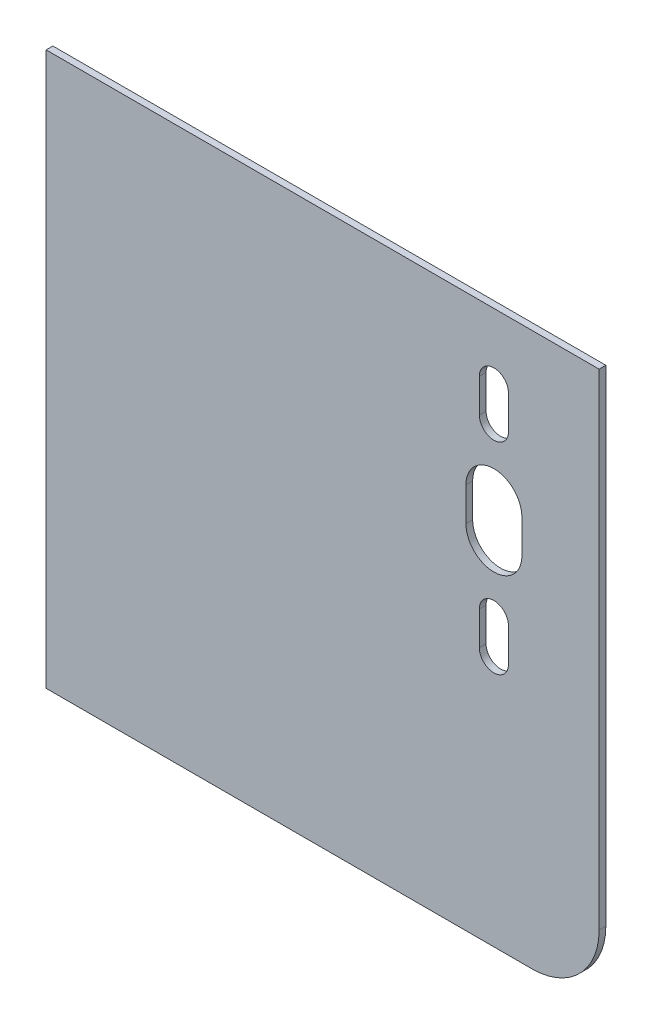
ISO-10303-21;
HEADER;
FILE_DESCRIPTION(('STEP AP214'),'2;1');
FILE_NAME('part.step','',(''),(''),'','','');
FILE_SCHEMA(('AUTOMOTIVE_DESIGN { 1 0 10303 214 1 1 1 1 }'));
ENDSEC;
DATA;
#1=APPLICATION_CONTEXT('core data for automotive mechanical design processes');
#2=APPLICATION_PROTOCOL_DEFINITION('international standard','automotive_design',2000,#1);
#3=PRODUCT_CONTEXT('',#1,'mechanical');
#4=PRODUCT('Part','Part','',(#3));
#5=PRODUCT_RELATED_PRODUCT_CATEGORY('part','',(#4));
#6=PRODUCT_DEFINITION_FORMATION('','',#4);
#7=PRODUCT_DEFINITION_CONTEXT('part definition',#1,'design');
#8=PRODUCT_DEFINITION('design','',#6,#7);
#9=PRODUCT_DEFINITION_SHAPE('','',#8);
#10=(LENGTH_UNIT() NAMED_UNIT(*) SI_UNIT(.MILLI.,.METRE.));
#11=(NAMED_UNIT(*) PLANE_ANGLE_UNIT() SI_UNIT($,.RADIAN.));
#12=(NAMED_UNIT(*) SI_UNIT($,.STERADIAN.) SOLID_ANGLE_UNIT());
#13=UNCERTAINTY_MEASURE_WITH_UNIT(LENGTH_MEASURE(1.E-05),#10,'distance_accuracy_value','');
#14=(GEOMETRIC_REPRESENTATION_CONTEXT(3) GLOBAL_UNCERTAINTY_ASSIGNED_CONTEXT((#13)) GLOBAL_UNIT_ASSIGNED_CONTEXT((#10,
#11,#12)) REPRESENTATION_CONTEXT('',''));
#15=CARTESIAN_POINT('',(0.,0.,0.));
#16=DIRECTION('',(0.,0.,1.));
#17=DIRECTION('',(1.,0.,0.));
#18=AXIS2_PLACEMENT_3D('',#15,#16,#17);
#19=CARTESIAN_POINT('',(0.,0.,3.));
#20=DIRECTION('',(0.,0.,-1.));
#21=DIRECTION('',(-1.,0.,0.));
#22=AXIS2_PLACEMENT_3D('',#19,#20,#21);
#23=PLANE('',#22);
#24=DIRECTION('',(1.,0.,0.));
#25=VECTOR('',#24,1.);
#26=CARTESIAN_POINT('',(-123.5,-123.5,3.));
#27=LINE('',#26,#25);
#28=CARTESIAN_POINT('',(-123.5,-123.5,3.));
#29=VERTEX_POINT('',#28);
#30=CARTESIAN_POINT('',(93.5,-123.5,3.));
#31=VERTEX_POINT('',#30);
#32=EDGE_CURVE('E259',#29,#31,#27,.T.);
#33=ORIENTED_EDGE('',*,*,#32,.T.);
#34=CARTESIAN_POINT('',(93.5,-93.5,3.));
#35=DIRECTION('',(0.,0.,-1.));
#36=DIRECTION('',(-1.,0.,0.));
#37=AXIS2_PLACEMENT_3D('',#34,#35,#36);
#38=CIRCLE('',#37,30.);
#39=CARTESIAN_POINT('',(123.5,-93.5,3.));
#40=VERTEX_POINT('',#39);
#41=EDGE_CURVE('E11',#31,#40,#38,.F.);
#42=ORIENTED_EDGE('',*,*,#41,.T.);
#43=DIRECTION('',(0.,1.,0.));
#44=VECTOR('',#43,1.);
#45=CARTESIAN_POINT('',(123.5,-123.5,3.));
#46=LINE('',#45,#44);
#47=CARTESIAN_POINT('',(123.5,123.5,3.));
#48=VERTEX_POINT('',#47);
#49=EDGE_CURVE('E252',#40,#48,#46,.T.);
#50=ORIENTED_EDGE('',*,*,#49,.T.);
#51=DIRECTION('',(-1.,0.,0.));
#52=VECTOR('',#51,1.);
#53=CARTESIAN_POINT('',(-123.5,123.5,3.));
#54=LINE('',#53,#52);
#55=CARTESIAN_POINT('',(-123.5,123.5,3.));
#56=VERTEX_POINT('',#55);
#57=EDGE_CURVE('E254',#48,#56,#54,.T.);
#58=ORIENTED_EDGE('',*,*,#57,.T.);
#59=DIRECTION('',(0.,-1.,0.));
#60=VECTOR('',#59,1.);
#61=CARTESIAN_POINT('',(-123.5,-123.5,3.));
#62=LINE('',#61,#60);
#63=EDGE_CURVE('E257',#56,#29,#62,.T.);
#64=ORIENTED_EDGE('',*,*,#63,.T.);
#65=EDGE_LOOP('',(#33,#42,#50,#58,#64));
#66=FACE_BOUND('',#65,.T.);
#67=DIRECTION('',(0.,-1.,0.));
#68=VECTOR('',#67,1.);
#69=CARTESIAN_POINT('',(89.,0.,3.));
#70=LINE('',#69,#68);
#71=CARTESIAN_POINT('',(89.,49.,3.));
#72=VERTEX_POINT('',#71);
#73=CARTESIAN_POINT('',(89.,34.,3.));
#74=VERTEX_POINT('',#73);
#75=EDGE_CURVE('E235',#72,#74,#70,.T.);
#76=ORIENTED_EDGE('',*,*,#75,.T.);
#77=CARTESIAN_POINT('',(76.5,34.,3.));
#78=DIRECTION('',(0.,0.,-1.));
#79=DIRECTION('',(-1.,0.,0.));
#80=AXIS2_PLACEMENT_3D('',#77,#78,#79);
#81=CIRCLE('',#80,12.5);
#82=CARTESIAN_POINT('',(64.,34.,3.));
#83=VERTEX_POINT('',#82);
#84=EDGE_CURVE('E240',#74,#83,#81,.T.);
#85=ORIENTED_EDGE('',*,*,#84,.T.);
#86=DIRECTION('',(0.,1.,0.));
#87=VECTOR('',#86,1.);
#88=CARTESIAN_POINT('',(64.,0.,3.));
#89=LINE('',#88,#87);
#90=CARTESIAN_POINT('',(64.,49.,3.));
#91=VERTEX_POINT('',#90);
#92=EDGE_CURVE('E233',#83,#91,#89,.T.);
#93=ORIENTED_EDGE('',*,*,#92,.T.);
#94=CARTESIAN_POINT('',(76.5,49.,3.));
#95=DIRECTION('',(0.,0.,-1.));
#96=DIRECTION('',(-1.,0.,0.));
#97=AXIS2_PLACEMENT_3D('',#94,#95,#96);
#98=CIRCLE('',#97,12.5);
#99=EDGE_CURVE('E237',#91,#72,#98,.T.);
#100=ORIENTED_EDGE('',*,*,#99,.T.);
#101=EDGE_LOOP('',(#76,#85,#93,#100));
#102=FACE_BOUND('',#101,.T.);
#103=DIRECTION('',(0.,-1.,0.));
#104=VECTOR('',#103,1.);
#105=CARTESIAN_POINT('',(83.,0.,3.));
#106=LINE('',#105,#104);
#107=CARTESIAN_POINT('',(83.,94.,3.));
#108=VERTEX_POINT('',#107);
#109=CARTESIAN_POINT('',(83.,79.,3.));
#110=VERTEX_POINT('',#109);
#111=EDGE_CURVE('E231',#108,#110,#106,.T.);
#112=ORIENTED_EDGE('',*,*,#111,.T.);
#113=CARTESIAN_POINT('',(76.5,79.,3.));
#114=DIRECTION('',(0.,0.,-1.));
#115=DIRECTION('',(-1.,0.,0.));
#116=AXIS2_PLACEMENT_3D('',#113,#114,#115);
#117=CIRCLE('',#116,6.50000000000001);
#118=CARTESIAN_POINT('',(70.,79.,3.));
#119=VERTEX_POINT('',#118);
#120=EDGE_CURVE('E249',#110,#119,#117,.T.);
#121=ORIENTED_EDGE('',*,*,#120,.T.);
#122=DIRECTION('',(0.,1.,0.));
#123=VECTOR('',#122,1.);
#124=CARTESIAN_POINT('',(70.,0.,3.));
#125=LINE('',#124,#123);
#126=CARTESIAN_POINT('',(70.,94.,3.));
#127=VERTEX_POINT('',#126);
#128=EDGE_CURVE('E48',#119,#127,#125,.T.);
#129=ORIENTED_EDGE('',*,*,#128,.T.);
#130=CARTESIAN_POINT('',(76.5,94.,3.));
#131=DIRECTION('',(0.,0.,-1.));
#132=DIRECTION('',(-1.,0.,0.));
#133=AXIS2_PLACEMENT_3D('',#130,#131,#132);
#134=CIRCLE('',#133,6.50000000000001);
#135=EDGE_CURVE('E247',#127,#108,#134,.T.);
#136=ORIENTED_EDGE('',*,*,#135,.T.);
#137=EDGE_LOOP('',(#112,#121,#129,#136));
#138=FACE_BOUND('',#137,.T.);
#139=DIRECTION('',(0.,-1.,0.));
#140=VECTOR('',#139,1.);
#141=CARTESIAN_POINT('',(83.,0.,3.));
#142=LINE('',#141,#140);
#143=CARTESIAN_POINT('',(83.,4.,3.));
#144=VERTEX_POINT('',#143);
#145=CARTESIAN_POINT('',(83.,-11.,3.));
#146=VERTEX_POINT('',#145);
#147=EDGE_CURVE('E228',#144,#146,#142,.T.);
#148=ORIENTED_EDGE('',*,*,#147,.T.);
#149=CARTESIAN_POINT('',(76.5,-11.,3.));
#150=DIRECTION('',(0.,0.,-1.));
#151=DIRECTION('',(-1.,0.,0.));
#152=AXIS2_PLACEMENT_3D('',#149,#150,#151);
#153=CIRCLE('',#152,6.50000000000001);
#154=CARTESIAN_POINT('',(70.,-11.,3.));
#155=VERTEX_POINT('',#154);
#156=EDGE_CURVE('E245',#146,#155,#153,.T.);
#157=ORIENTED_EDGE('',*,*,#156,.T.);
#158=DIRECTION('',(0.,1.,0.));
#159=VECTOR('',#158,1.);
#160=CARTESIAN_POINT('',(70.,0.,3.));
#161=LINE('',#160,#159);
#162=CARTESIAN_POINT('',(70.,4.,3.));
#163=VERTEX_POINT('',#162);
#164=EDGE_CURVE('E56',#155,#163,#161,.T.);
#165=ORIENTED_EDGE('',*,*,#164,.T.);
#166=CARTESIAN_POINT('',(76.5,4.,3.));
#167=DIRECTION('',(0.,0.,-1.));
#168=DIRECTION('',(-1.,0.,0.));
#169=AXIS2_PLACEMENT_3D('',#166,#167,#168);
#170=CIRCLE('',#169,6.50000000000001);
#171=EDGE_CURVE('E243',#163,#144,#170,.T.);
#172=ORIENTED_EDGE('',*,*,#171,.T.);
#173=EDGE_LOOP('',(#148,#157,#165,#172));
#174=FACE_BOUND('',#173,.T.);
#175=ADVANCED_FACE('F33',(#66,#102,#138,#174),#23,.F.);
#176=CARTESIAN_POINT('',(0.,0.,0.));
#177=DIRECTION('',(0.,0.,-1.));
#178=DIRECTION('',(-1.,0.,0.));
#179=AXIS2_PLACEMENT_3D('',#176,#177,#178);
#180=PLANE('',#179);
#181=CARTESIAN_POINT('',(76.5,79.,0.));
#182=DIRECTION('',(0.,0.,-1.));
#183=DIRECTION('',(-1.,0.,0.));
#184=AXIS2_PLACEMENT_3D('',#181,#182,#183);
#185=CIRCLE('',#184,6.50000000000001);
#186=CARTESIAN_POINT('',(83.,79.,0.));
#187=VERTEX_POINT('',#186);
#188=CARTESIAN_POINT('',(70.,79.,0.));
#189=VERTEX_POINT('',#188);
#190=EDGE_CURVE('E160',#187,#189,#185,.T.);
#191=ORIENTED_EDGE('',*,*,#190,.F.);
#192=DIRECTION('',(0.,-1.,0.));
#193=VECTOR('',#192,1.);
#194=CARTESIAN_POINT('',(83.,79.,0.));
#195=LINE('',#194,#193);
#196=CARTESIAN_POINT('',(83.,94.,0.));
#197=VERTEX_POINT('',#196);
#198=EDGE_CURVE('E171',#197,#187,#195,.T.);
#199=ORIENTED_EDGE('',*,*,#198,.F.);
#200=CARTESIAN_POINT('',(76.5,94.,0.));
#201=DIRECTION('',(0.,0.,-1.));
#202=DIRECTION('',(-1.,0.,0.));
#203=AXIS2_PLACEMENT_3D('',#200,#201,#202);
#204=CIRCLE('',#203,6.50000000000001);
#205=CARTESIAN_POINT('',(70.,94.,0.));
#206=VERTEX_POINT('',#205);
#207=EDGE_CURVE('E162',#206,#197,#204,.T.);
#208=ORIENTED_EDGE('',*,*,#207,.F.);
#209=DIRECTION('',(0.,1.,0.));
#210=VECTOR('',#209,1.);
#211=CARTESIAN_POINT('',(70.,79.,0.));
#212=LINE('',#211,#210);
#213=EDGE_CURVE('E154',#189,#206,#212,.T.);
#214=ORIENTED_EDGE('',*,*,#213,.F.);
#215=EDGE_LOOP('',(#191,#199,#208,#214));
#216=FACE_BOUND('',#215,.T.);
#217=CARTESIAN_POINT('',(76.5,-11.,0.));
#218=DIRECTION('',(0.,0.,-1.));
#219=DIRECTION('',(-1.,0.,0.));
#220=AXIS2_PLACEMENT_3D('',#217,#218,#219);
#221=CIRCLE('',#220,6.50000000000001);
#222=CARTESIAN_POINT('',(83.,-11.,0.));
#223=VERTEX_POINT('',#222);
#224=CARTESIAN_POINT('',(70.,-11.,0.));
#225=VERTEX_POINT('',#224);
#226=EDGE_CURVE('E189',#223,#225,#221,.T.);
#227=ORIENTED_EDGE('',*,*,#226,.F.);
#228=DIRECTION('',(0.,-1.,0.));
#229=VECTOR('',#228,1.);
#230=CARTESIAN_POINT('',(83.,-11.,0.));
#231=LINE('',#230,#229);
#232=CARTESIAN_POINT('',(83.,4.,0.));
#233=VERTEX_POINT('',#232);
#234=EDGE_CURVE('E199',#233,#223,#231,.T.);
#235=ORIENTED_EDGE('',*,*,#234,.F.);
#236=CARTESIAN_POINT('',(76.5,4.,0.));
#237=DIRECTION('',(0.,0.,-1.));
#238=DIRECTION('',(-1.,0.,0.));
#239=AXIS2_PLACEMENT_3D('',#236,#237,#238);
#240=CIRCLE('',#239,6.50000000000001);
#241=CARTESIAN_POINT('',(70.,4.,0.));
#242=VERTEX_POINT('',#241);
#243=EDGE_CURVE('E196',#242,#233,#240,.T.);
#244=ORIENTED_EDGE('',*,*,#243,.F.);
#245=DIRECTION('',(0.,1.,0.));
#246=VECTOR('',#245,1.);
#247=CARTESIAN_POINT('',(70.,-11.,0.));
#248=LINE('',#247,#246);
#249=EDGE_CURVE('E192',#225,#242,#248,.T.);
#250=ORIENTED_EDGE('',*,*,#249,.F.);
#251=EDGE_LOOP('',(#227,#235,#244,#250));
#252=FACE_BOUND('',#251,.T.);
#253=CARTESIAN_POINT('',(76.5,34.,0.));
#254=DIRECTION('',(0.,0.,-1.));
#255=DIRECTION('',(-1.,0.,0.));
#256=AXIS2_PLACEMENT_3D('',#253,#254,#255);
#257=CIRCLE('',#256,12.5);
#258=CARTESIAN_POINT('',(89.,34.,0.));
#259=VERTEX_POINT('',#258);
#260=CARTESIAN_POINT('',(64.,34.,0.));
#261=VERTEX_POINT('',#260);
#262=EDGE_CURVE('E207',#259,#261,#257,.T.);
#263=ORIENTED_EDGE('',*,*,#262,.F.);
#264=DIRECTION('',(0.,-1.,0.));
#265=VECTOR('',#264,1.);
#266=CARTESIAN_POINT('',(89.,34.,0.));
#267=LINE('',#266,#265);
#268=CARTESIAN_POINT('',(89.,49.,0.));
#269=VERTEX_POINT('',#268);
#270=EDGE_CURVE('E216',#269,#259,#267,.T.);
#271=ORIENTED_EDGE('',*,*,#270,.F.);
#272=CARTESIAN_POINT('',(76.5,49.,0.));
#273=DIRECTION('',(0.,0.,-1.));
#274=DIRECTION('',(-1.,0.,0.));
#275=AXIS2_PLACEMENT_3D('',#272,#273,#274);
#276=CIRCLE('',#275,12.5);
#277=CARTESIAN_POINT('',(64.,49.,0.));
#278=VERTEX_POINT('',#277);
#279=EDGE_CURVE('E213',#278,#269,#276,.T.);
#280=ORIENTED_EDGE('',*,*,#279,.F.);
#281=DIRECTION('',(0.,1.,0.));
#282=VECTOR('',#281,1.);
#283=CARTESIAN_POINT('',(64.,34.,0.));
#284=LINE('',#283,#282);
#285=EDGE_CURVE('E210',#261,#278,#284,.T.);
#286=ORIENTED_EDGE('',*,*,#285,.F.);
#287=EDGE_LOOP('',(#263,#271,#280,#286));
#288=FACE_BOUND('',#287,.T.);
#289=DIRECTION('',(0.,1.,0.));
#290=VECTOR('',#289,1.);
#291=CARTESIAN_POINT('',(123.5,-123.5,0.));
#292=LINE('',#291,#290);
#293=CARTESIAN_POINT('',(123.5,-93.5,0.));
#294=VERTEX_POINT('',#293);
#295=CARTESIAN_POINT('',(123.5,123.5,0.));
#296=VERTEX_POINT('',#295);
#297=EDGE_CURVE('E251',#294,#296,#292,.T.);
#298=ORIENTED_EDGE('',*,*,#297,.F.);
#299=CARTESIAN_POINT('',(93.5,-93.5,0.));
#300=DIRECTION('',(0.,0.,-1.));
#301=DIRECTION('',(-1.,0.,0.));
#302=AXIS2_PLACEMENT_3D('',#299,#300,#301);
#303=CIRCLE('',#302,30.);
#304=CARTESIAN_POINT('',(93.5,-123.5,0.));
#305=VERTEX_POINT('',#304);
#306=EDGE_CURVE('E281',#294,#305,#303,.T.);
#307=ORIENTED_EDGE('',*,*,#306,.T.);
#308=DIRECTION('',(1.,0.,0.));
#309=VECTOR('',#308,1.);
#310=CARTESIAN_POINT('',(-123.5,-123.5,0.));
#311=LINE('',#310,#309);
#312=CARTESIAN_POINT('',(-123.5,-123.5,0.));
#313=VERTEX_POINT('',#312);
#314=EDGE_CURVE('E255',#313,#305,#311,.T.);
#315=ORIENTED_EDGE('',*,*,#314,.F.);
#316=DIRECTION('',(0.,-1.,0.));
#317=VECTOR('',#316,1.);
#318=CARTESIAN_POINT('',(-123.5,-123.5,0.));
#319=LINE('',#318,#317);
#320=CARTESIAN_POINT('',(-123.5,123.5,0.));
#321=VERTEX_POINT('',#320);
#322=EDGE_CURVE('E266',#321,#313,#319,.T.);
#323=ORIENTED_EDGE('',*,*,#322,.F.);
#324=DIRECTION('',(-1.,0.,0.));
#325=VECTOR('',#324,1.);
#326=CARTESIAN_POINT('',(-123.5,123.5,0.));
#327=LINE('',#326,#325);
#328=EDGE_CURVE('E264',#296,#321,#327,.T.);
#329=ORIENTED_EDGE('',*,*,#328,.F.);
#330=EDGE_LOOP('',(#298,#307,#315,#323,#329));
#331=FACE_BOUND('',#330,.T.);
#332=ADVANCED_FACE('F156',(#216,#252,#288,#331),#180,.T.);
#333=CARTESIAN_POINT('',(123.5,-123.5,3.));
#334=DIRECTION('',(-1.,0.,0.));
#335=DIRECTION('',(0.,0.,1.));
#336=AXIS2_PLACEMENT_3D('',#333,#334,#335);
#337=PLANE('',#336);
#338=ORIENTED_EDGE('',*,*,#49,.F.);
#339=DIRECTION('',(0.,0.,-1.));
#340=VECTOR('',#339,1.);
#341=CARTESIAN_POINT('',(123.5,-93.5,3.));
#342=LINE('',#341,#340);
#343=EDGE_CURVE('E278',#40,#294,#342,.T.);
#344=ORIENTED_EDGE('',*,*,#343,.T.);
#345=ORIENTED_EDGE('',*,*,#297,.T.);
#346=DIRECTION('',(0.,0.,-1.));
#347=VECTOR('',#346,1.);
#348=CARTESIAN_POINT('',(123.5,123.5,3.));
#349=LINE('',#348,#347);
#350=EDGE_CURVE('E275',#48,#296,#349,.T.);
#351=ORIENTED_EDGE('',*,*,#350,.F.);
#352=EDGE_LOOP('',(#338,#344,#345,#351));
#353=FACE_BOUND('',#352,.T.);
#354=ADVANCED_FACE('F297',(#353),#337,.F.);
#355=CARTESIAN_POINT('',(-123.5,123.5,3.));
#356=DIRECTION('',(0.,-1.,0.));
#357=DIRECTION('',(0.,0.,-1.));
#358=AXIS2_PLACEMENT_3D('',#355,#356,#357);
#359=PLANE('',#358);
#360=ORIENTED_EDGE('',*,*,#328,.T.);
#361=DIRECTION('',(0.,0.,-1.));
#362=VECTOR('',#361,1.);
#363=CARTESIAN_POINT('',(-123.5,123.5,3.));
#364=LINE('',#363,#362);
#365=EDGE_CURVE('E272',#56,#321,#364,.T.);
#366=ORIENTED_EDGE('',*,*,#365,.F.);
#367=ORIENTED_EDGE('',*,*,#57,.F.);
#368=ORIENTED_EDGE('',*,*,#350,.T.);
#369=EDGE_LOOP('',(#360,#366,#367,#368));
#370=FACE_BOUND('',#369,.T.);
#371=ADVANCED_FACE('F305',(#370),#359,.F.);
#372=CARTESIAN_POINT('',(-123.5,-123.5,3.));
#373=DIRECTION('',(1.,0.,0.));
#374=DIRECTION('',(0.,0.,-1.));
#375=AXIS2_PLACEMENT_3D('',#372,#373,#374);
#376=PLANE('',#375);
#377=ORIENTED_EDGE('',*,*,#322,.T.);
#378=DIRECTION('',(0.,0.,-1.));
#379=VECTOR('',#378,1.);
#380=CARTESIAN_POINT('',(-123.5,-123.5,3.));
#381=LINE('',#380,#379);
#382=EDGE_CURVE('E262',#29,#313,#381,.T.);
#383=ORIENTED_EDGE('',*,*,#382,.F.);
#384=ORIENTED_EDGE('',*,*,#63,.F.);
#385=ORIENTED_EDGE('',*,*,#365,.T.);
#386=EDGE_LOOP('',(#377,#383,#384,#385));
#387=FACE_BOUND('',#386,.T.);
#388=ADVANCED_FACE('F307',(#387),#376,.F.);
#389=CARTESIAN_POINT('',(-123.5,-123.5,3.));
#390=DIRECTION('',(0.,1.,0.));
#391=DIRECTION('',(0.,0.,1.));
#392=AXIS2_PLACEMENT_3D('',#389,#390,#391);
#393=PLANE('',#392);
#394=ORIENTED_EDGE('',*,*,#314,.T.);
#395=DIRECTION('',(0.,0.,-1.));
#396=VECTOR('',#395,1.);
#397=CARTESIAN_POINT('',(93.5,-123.5,3.));
#398=LINE('',#397,#396);
#399=EDGE_CURVE('E41',#305,#31,#398,.F.);
#400=ORIENTED_EDGE('',*,*,#399,.T.);
#401=ORIENTED_EDGE('',*,*,#32,.F.);
#402=ORIENTED_EDGE('',*,*,#382,.T.);
#403=EDGE_LOOP('',(#394,#400,#401,#402));
#404=FACE_BOUND('',#403,.T.);
#405=ADVANCED_FACE('F285',(#404),#393,.F.);
#406=CARTESIAN_POINT('',(93.5,-93.5,3.));
#407=DIRECTION('',(0.,0.,-1.));
#408=DIRECTION('',(-1.,0.,0.));
#409=AXIS2_PLACEMENT_3D('',#406,#407,#408);
#410=CYLINDRICAL_SURFACE('',#409,30.);
#411=ORIENTED_EDGE('',*,*,#41,.F.);
#412=ORIENTED_EDGE('',*,*,#399,.F.);
#413=ORIENTED_EDGE('',*,*,#306,.F.);
#414=ORIENTED_EDGE('',*,*,#343,.F.);
#415=EDGE_LOOP('',(#411,#412,#413,#414));
#416=FACE_BOUND('',#415,.T.);
#417=ADVANCED_FACE('F35',(#416),#410,.T.);
#418=CARTESIAN_POINT('',(76.5,34.,10.));
#419=DIRECTION('',(0.,0.,-1.));
#420=DIRECTION('',(-1.,0.,0.));
#421=AXIS2_PLACEMENT_3D('',#418,#419,#420);
#422=CYLINDRICAL_SURFACE('',#421,12.5);
#423=DIRECTION('',(0.,0.,-1.));
#424=VECTOR('',#423,1.);
#425=CARTESIAN_POINT('',(89.,34.,10.));
#426=LINE('',#425,#424);
#427=EDGE_CURVE('E193',#74,#259,#426,.T.);
#428=ORIENTED_EDGE('',*,*,#427,.T.);
#429=ORIENTED_EDGE('',*,*,#262,.T.);
#430=DIRECTION('',(0.,0.,-1.));
#431=VECTOR('',#430,1.);
#432=CARTESIAN_POINT('',(64.,34.,10.));
#433=LINE('',#432,#431);
#434=EDGE_CURVE('E218',#83,#261,#433,.T.);
#435=ORIENTED_EDGE('',*,*,#434,.F.);
#436=ORIENTED_EDGE('',*,*,#84,.F.);
#437=EDGE_LOOP('',(#428,#429,#435,#436));
#438=FACE_BOUND('',#437,.T.);
#439=ADVANCED_FACE('F323',(#438),#422,.F.);
#440=CARTESIAN_POINT('',(76.5,49.,10.));
#441=DIRECTION('',(0.,0.,-1.));
#442=DIRECTION('',(-1.,0.,0.));
#443=AXIS2_PLACEMENT_3D('',#440,#441,#442);
#444=CYLINDRICAL_SURFACE('',#443,12.5);
#445=DIRECTION('',(0.,0.,-1.));
#446=VECTOR('',#445,1.);
#447=CARTESIAN_POINT('',(64.,49.,10.));
#448=LINE('',#447,#446);
#449=EDGE_CURVE('E223',#91,#278,#448,.T.);
#450=ORIENTED_EDGE('',*,*,#449,.T.);
#451=ORIENTED_EDGE('',*,*,#279,.T.);
#452=DIRECTION('',(0.,0.,-1.));
#453=VECTOR('',#452,1.);
#454=CARTESIAN_POINT('',(89.,49.,10.));
#455=LINE('',#454,#453);
#456=EDGE_CURVE('E221',#72,#269,#455,.T.);
#457=ORIENTED_EDGE('',*,*,#456,.F.);
#458=ORIENTED_EDGE('',*,*,#99,.F.);
#459=EDGE_LOOP('',(#450,#451,#457,#458));
#460=FACE_BOUND('',#459,.T.);
#461=ADVANCED_FACE('F326',(#460),#444,.F.);
#462=CARTESIAN_POINT('',(89.,34.,10.));
#463=DIRECTION('',(1.,0.,0.));
#464=DIRECTION('',(0.,0.,-1.));
#465=AXIS2_PLACEMENT_3D('',#462,#463,#464);
#466=PLANE('',#465);
#467=ORIENTED_EDGE('',*,*,#456,.T.);
#468=ORIENTED_EDGE('',*,*,#270,.T.);
#469=ORIENTED_EDGE('',*,*,#427,.F.);
#470=ORIENTED_EDGE('',*,*,#75,.F.);
#471=EDGE_LOOP('',(#467,#468,#469,#470));
#472=FACE_BOUND('',#471,.T.);
#473=ADVANCED_FACE('F332',(#472),#466,.F.);
#474=CARTESIAN_POINT('',(64.,34.,10.));
#475=DIRECTION('',(-1.,0.,0.));
#476=DIRECTION('',(0.,0.,1.));
#477=AXIS2_PLACEMENT_3D('',#474,#475,#476);
#478=PLANE('',#477);
#479=ORIENTED_EDGE('',*,*,#434,.T.);
#480=ORIENTED_EDGE('',*,*,#285,.T.);
#481=ORIENTED_EDGE('',*,*,#449,.F.);
#482=ORIENTED_EDGE('',*,*,#92,.F.);
#483=EDGE_LOOP('',(#479,#480,#481,#482));
#484=FACE_BOUND('',#483,.T.);
#485=ADVANCED_FACE('F328',(#484),#478,.F.);
#486=CARTESIAN_POINT('',(76.5,-11.,10.));
#487=DIRECTION('',(0.,0.,-1.));
#488=DIRECTION('',(-1.,0.,0.));
#489=AXIS2_PLACEMENT_3D('',#486,#487,#488);
#490=CYLINDRICAL_SURFACE('',#489,6.50000000000001);
#491=DIRECTION('',(0.,0.,-1.));
#492=VECTOR('',#491,1.);
#493=CARTESIAN_POINT('',(83.,-11.,10.));
#494=LINE('',#493,#492);
#495=EDGE_CURVE('E177',#146,#223,#494,.T.);
#496=ORIENTED_EDGE('',*,*,#495,.T.);
#497=ORIENTED_EDGE('',*,*,#226,.T.);
#498=DIRECTION('',(0.,0.,-1.));
#499=VECTOR('',#498,1.);
#500=CARTESIAN_POINT('',(70.,-11.,10.));
#501=LINE('',#500,#499);
#502=EDGE_CURVE('E200',#155,#225,#501,.T.);
#503=ORIENTED_EDGE('',*,*,#502,.F.);
#504=ORIENTED_EDGE('',*,*,#156,.F.);
#505=EDGE_LOOP('',(#496,#497,#503,#504));
#506=FACE_BOUND('',#505,.T.);
#507=ADVANCED_FACE('F331',(#506),#490,.F.);
#508=CARTESIAN_POINT('',(76.5,4.,10.));
#509=DIRECTION('',(0.,0.,-1.));
#510=DIRECTION('',(-1.,0.,0.));
#511=AXIS2_PLACEMENT_3D('',#508,#509,#510);
#512=CYLINDRICAL_SURFACE('',#511,6.50000000000001);
#513=DIRECTION('',(0.,0.,-1.));
#514=VECTOR('',#513,1.);
#515=CARTESIAN_POINT('',(70.,4.,10.));
#516=LINE('',#515,#514);
#517=EDGE_CURVE('E203',#163,#242,#516,.T.);
#518=ORIENTED_EDGE('',*,*,#517,.T.);
#519=ORIENTED_EDGE('',*,*,#243,.T.);
#520=DIRECTION('',(0.,0.,-1.));
#521=VECTOR('',#520,1.);
#522=CARTESIAN_POINT('',(83.,4.,10.));
#523=LINE('',#522,#521);
#524=EDGE_CURVE('E180',#144,#233,#523,.T.);
#525=ORIENTED_EDGE('',*,*,#524,.F.);
#526=ORIENTED_EDGE('',*,*,#171,.F.);
#527=EDGE_LOOP('',(#518,#519,#525,#526));
#528=FACE_BOUND('',#527,.T.);
#529=ADVANCED_FACE('F342',(#528),#512,.F.);
#530=CARTESIAN_POINT('',(83.,-11.,10.));
#531=DIRECTION('',(1.,0.,0.));
#532=DIRECTION('',(0.,0.,-1.));
#533=AXIS2_PLACEMENT_3D('',#530,#531,#532);
#534=PLANE('',#533);
#535=ORIENTED_EDGE('',*,*,#524,.T.);
#536=ORIENTED_EDGE('',*,*,#234,.T.);
#537=ORIENTED_EDGE('',*,*,#495,.F.);
#538=ORIENTED_EDGE('',*,*,#147,.F.);
#539=EDGE_LOOP('',(#535,#536,#537,#538));
#540=FACE_BOUND('',#539,.T.);
#541=ADVANCED_FACE('F347',(#540),#534,.F.);
#542=CARTESIAN_POINT('',(70.,-11.,10.));
#543=DIRECTION('',(-1.,0.,0.));
#544=DIRECTION('',(0.,0.,1.));
#545=AXIS2_PLACEMENT_3D('',#542,#543,#544);
#546=PLANE('',#545);
#547=ORIENTED_EDGE('',*,*,#502,.T.);
#548=ORIENTED_EDGE('',*,*,#249,.T.);
#549=ORIENTED_EDGE('',*,*,#517,.F.);
#550=ORIENTED_EDGE('',*,*,#164,.F.);
#551=EDGE_LOOP('',(#547,#548,#549,#550));
#552=FACE_BOUND('',#551,.T.);
#553=ADVANCED_FACE('F344',(#552),#546,.F.);
#554=CARTESIAN_POINT('',(76.5,79.,10.));
#555=DIRECTION('',(0.,0.,-1.));
#556=DIRECTION('',(-1.,0.,0.));
#557=AXIS2_PLACEMENT_3D('',#554,#555,#556);
#558=CYLINDRICAL_SURFACE('',#557,6.50000000000001);
#559=DIRECTION('',(0.,0.,-1.));
#560=VECTOR('',#559,1.);
#561=CARTESIAN_POINT('',(83.,79.,10.));
#562=LINE('',#561,#560);
#563=EDGE_CURVE('E176',#110,#187,#562,.T.);
#564=ORIENTED_EDGE('',*,*,#563,.T.);
#565=ORIENTED_EDGE('',*,*,#190,.T.);
#566=DIRECTION('',(0.,0.,-1.));
#567=VECTOR('',#566,1.);
#568=CARTESIAN_POINT('',(70.,79.,10.));
#569=LINE('',#568,#567);
#570=EDGE_CURVE('E166',#119,#189,#569,.T.);
#571=ORIENTED_EDGE('',*,*,#570,.F.);
#572=ORIENTED_EDGE('',*,*,#120,.F.);
#573=EDGE_LOOP('',(#564,#565,#571,#572));
#574=FACE_BOUND('',#573,.T.);
#575=ADVANCED_FACE('F174',(#574),#558,.F.);
#576=CARTESIAN_POINT('',(76.5,94.,10.));
#577=DIRECTION('',(0.,0.,-1.));
#578=DIRECTION('',(-1.,0.,0.));
#579=AXIS2_PLACEMENT_3D('',#576,#577,#578);
#580=CYLINDRICAL_SURFACE('',#579,6.50000000000001);
#581=DIRECTION('',(0.,0.,-1.));
#582=VECTOR('',#581,1.);
#583=CARTESIAN_POINT('',(70.,94.,10.));
#584=LINE('',#583,#582);
#585=EDGE_CURVE('E170',#127,#206,#584,.T.);
#586=ORIENTED_EDGE('',*,*,#585,.T.);
#587=ORIENTED_EDGE('',*,*,#207,.T.);
#588=DIRECTION('',(0.,0.,-1.));
#589=VECTOR('',#588,1.);
#590=CARTESIAN_POINT('',(83.,94.,10.));
#591=LINE('',#590,#589);
#592=EDGE_CURVE('E186',#108,#197,#591,.T.);
#593=ORIENTED_EDGE('',*,*,#592,.F.);
#594=ORIENTED_EDGE('',*,*,#135,.F.);
#595=EDGE_LOOP('',(#586,#587,#593,#594));
#596=FACE_BOUND('',#595,.T.);
#597=ADVANCED_FACE('F357',(#596),#580,.F.);
#598=CARTESIAN_POINT('',(83.,79.,10.));
#599=DIRECTION('',(1.,0.,0.));
#600=DIRECTION('',(0.,0.,-1.));
#601=AXIS2_PLACEMENT_3D('',#598,#599,#600);
#602=PLANE('',#601);
#603=ORIENTED_EDGE('',*,*,#592,.T.);
#604=ORIENTED_EDGE('',*,*,#198,.T.);
#605=ORIENTED_EDGE('',*,*,#563,.F.);
#606=ORIENTED_EDGE('',*,*,#111,.F.);
#607=EDGE_LOOP('',(#603,#604,#605,#606));
#608=FACE_BOUND('',#607,.T.);
#609=ADVANCED_FACE('F360',(#608),#602,.F.);
#610=CARTESIAN_POINT('',(70.,79.,10.));
#611=DIRECTION('',(-1.,0.,0.));
#612=DIRECTION('',(0.,0.,1.));
#613=AXIS2_PLACEMENT_3D('',#610,#611,#612);
#614=PLANE('',#613);
#615=ORIENTED_EDGE('',*,*,#570,.T.);
#616=ORIENTED_EDGE('',*,*,#213,.T.);
#617=ORIENTED_EDGE('',*,*,#585,.F.);
#618=ORIENTED_EDGE('',*,*,#128,.F.);
#619=EDGE_LOOP('',(#615,#616,#617,#618));
#620=FACE_BOUND('',#619,.T.);
#621=ADVANCED_FACE('F167',(#620),#614,.F.);
#622=CLOSED_SHELL('',(#175,#332,#354,#371,#388,#405,#417,#439,#461,#473,#485,#507,#529,#541,
#553,#575,#597,#609,#621));
#623=MANIFOLD_SOLID_BREP('B2',#622);
#624=ADVANCED_BREP_SHAPE_REPRESENTATION('',(#18,#623),#14);
#625=SHAPE_DEFINITION_REPRESENTATION(#9,#624);
ENDSEC;
END-ISO-10303-21;
